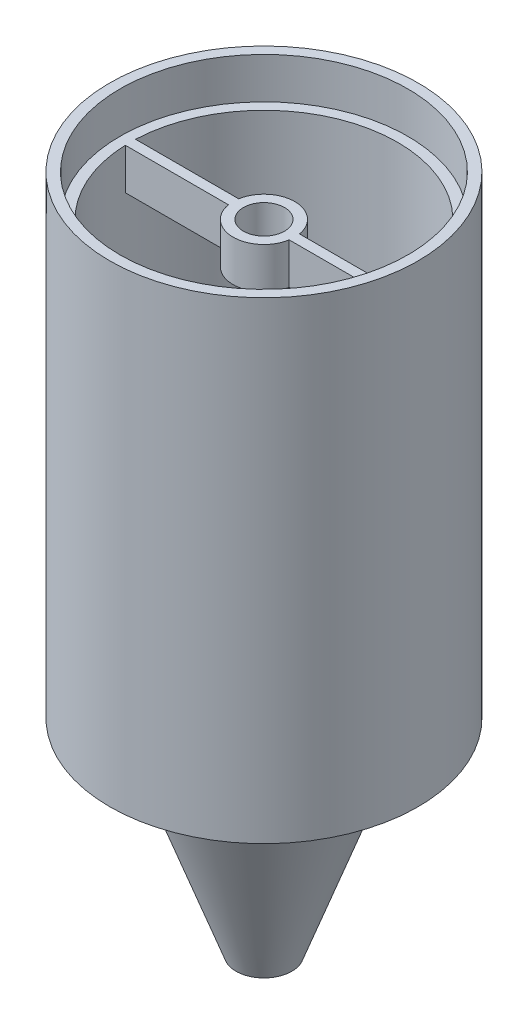
ISO-10303-21;
HEADER;
FILE_DESCRIPTION(('STEP AP214'),'2;1');
FILE_NAME('part.step','',(''),(''),'','','');
FILE_SCHEMA(('AUTOMOTIVE_DESIGN { 1 0 10303 214 1 1 1 1 }'));
ENDSEC;
DATA;
#1=APPLICATION_CONTEXT('core data for automotive mechanical design processes');
#2=APPLICATION_PROTOCOL_DEFINITION('international standard','automotive_design',2000,#1);
#3=PRODUCT_CONTEXT('',#1,'mechanical');
#4=PRODUCT('Part','Part','',(#3));
#5=PRODUCT_RELATED_PRODUCT_CATEGORY('part','',(#4));
#6=PRODUCT_DEFINITION_FORMATION('','',#4);
#7=PRODUCT_DEFINITION_CONTEXT('part definition',#1,'design');
#8=PRODUCT_DEFINITION('design','',#6,#7);
#9=PRODUCT_DEFINITION_SHAPE('','',#8);
#10=(LENGTH_UNIT() NAMED_UNIT(*) SI_UNIT(.MILLI.,.METRE.));
#11=(NAMED_UNIT(*) PLANE_ANGLE_UNIT() SI_UNIT($,.RADIAN.));
#12=(NAMED_UNIT(*) SI_UNIT($,.STERADIAN.) SOLID_ANGLE_UNIT());
#13=UNCERTAINTY_MEASURE_WITH_UNIT(LENGTH_MEASURE(1.E-05),#10,'distance_accuracy_value','');
#14=(GEOMETRIC_REPRESENTATION_CONTEXT(3) GLOBAL_UNCERTAINTY_ASSIGNED_CONTEXT((#13)) GLOBAL_UNIT_ASSIGNED_CONTEXT((#10,
#11,#12)) REPRESENTATION_CONTEXT('',''));
#15=CARTESIAN_POINT('',(0.,0.,0.));
#16=DIRECTION('',(0.,0.,1.));
#17=DIRECTION('',(1.,0.,0.));
#18=AXIS2_PLACEMENT_3D('',#15,#16,#17);
#19=CARTESIAN_POINT('',(0.,53.34,0.));
#20=DIRECTION('',(0.,-1.,0.));
#21=DIRECTION('',(0.,0.,-1.));
#22=AXIS2_PLACEMENT_3D('',#19,#20,#21);
#23=CYLINDRICAL_SURFACE('',#22,16.51);
#24=CARTESIAN_POINT('',(0.,2.54,0.));
#25=DIRECTION('',(0.,1.,0.));
#26=DIRECTION('',(0.,0.,1.));
#27=AXIS2_PLACEMENT_3D('',#24,#25,#26);
#28=CIRCLE('',#27,16.51);
#29=CARTESIAN_POINT('',(0.,2.54,16.51));
#30=VERTEX_POINT('',#29);
#31=EDGE_CURVE('E180',#30,#30,#28,.F.);
#32=ORIENTED_EDGE('',*,*,#31,.T.);
#33=EDGE_LOOP('',(#32));
#34=FACE_BOUND('',#33,.T.);
#35=CARTESIAN_POINT('',(0.,48.26,0.));
#36=DIRECTION('',(0.,1.,0.));
#37=DIRECTION('',(0.,0.,1.));
#38=AXIS2_PLACEMENT_3D('',#35,#36,#37);
#39=CIRCLE('',#38,16.51);
#40=CARTESIAN_POINT('',(-16.4977839420936,48.26,-0.635000000000003));
#41=VERTEX_POINT('',#40);
#42=CARTESIAN_POINT('',(-16.4977839420936,48.26,0.634999999999997));
#43=VERTEX_POINT('',#42);
#44=EDGE_CURVE('E182',#41,#43,#39,.T.);
#45=ORIENTED_EDGE('',*,*,#44,.T.);
#46=DIRECTION('',(0.,1.,0.));
#47=VECTOR('',#46,1.);
#48=CARTESIAN_POINT('',(-16.4977839420936,48.26,0.634999999999997));
#49=LINE('',#48,#47);
#50=CARTESIAN_POINT('',(-16.4977839420936,53.34,0.634999999999997));
#51=VERTEX_POINT('',#50);
#52=EDGE_CURVE('E104',#43,#51,#49,.T.);
#53=ORIENTED_EDGE('',*,*,#52,.T.);
#54=CARTESIAN_POINT('',(0.,53.34,0.));
#55=DIRECTION('',(0.,1.,0.));
#56=DIRECTION('',(0.,0.,1.));
#57=AXIS2_PLACEMENT_3D('',#54,#55,#56);
#58=CIRCLE('',#57,16.51);
#59=CARTESIAN_POINT('',(16.4977839420936,53.34,0.634999999999997));
#60=VERTEX_POINT('',#59);
#61=EDGE_CURVE('E159',#51,#60,#58,.T.);
#62=ORIENTED_EDGE('',*,*,#61,.T.);
#63=DIRECTION('',(0.,1.,0.));
#64=VECTOR('',#63,1.);
#65=CARTESIAN_POINT('',(16.4977839420936,48.26,0.634999999999997));
#66=LINE('',#65,#64);
#67=CARTESIAN_POINT('',(16.4977839420936,48.26,0.634999999999997));
#68=VERTEX_POINT('',#67);
#69=EDGE_CURVE('E112',#68,#60,#66,.T.);
#70=ORIENTED_EDGE('',*,*,#69,.F.);
#71=CARTESIAN_POINT('',(16.4977839420936,48.26,-0.635000000000003));
#72=VERTEX_POINT('',#71);
#73=EDGE_CURVE('E40',#68,#72,#39,.T.);
#74=ORIENTED_EDGE('',*,*,#73,.T.);
#75=DIRECTION('',(0.,1.,0.));
#76=VECTOR('',#75,1.);
#77=CARTESIAN_POINT('',(16.4977839420936,48.26,-0.635000000000003));
#78=LINE('',#77,#76);
#79=CARTESIAN_POINT('',(16.4977839420936,53.34,-0.635000000000003));
#80=VERTEX_POINT('',#79);
#81=EDGE_CURVE('E147',#72,#80,#78,.T.);
#82=ORIENTED_EDGE('',*,*,#81,.T.);
#83=CARTESIAN_POINT('',(-16.4977839420936,53.34,-0.635000000000003));
#84=VERTEX_POINT('',#83);
#85=EDGE_CURVE('E164',#80,#84,#58,.T.);
#86=ORIENTED_EDGE('',*,*,#85,.T.);
#87=DIRECTION('',(0.,1.,0.));
#88=VECTOR('',#87,1.);
#89=CARTESIAN_POINT('',(-16.4977839420936,48.26,-0.635000000000003));
#90=LINE('',#89,#88);
#91=EDGE_CURVE('E140',#41,#84,#90,.T.);
#92=ORIENTED_EDGE('',*,*,#91,.F.);
#93=EDGE_LOOP('',(#45,#53,#62,#70,#74,#82,#86,#92));
#94=FACE_BOUND('',#93,.T.);
#95=ADVANCED_FACE('F32',(#34,#94),#23,.F.);
#96=CARTESIAN_POINT('',(0.,0.,0.));
#97=DIRECTION('',(0.,1.,0.));
#98=DIRECTION('',(0.,0.,1.));
#99=AXIS2_PLACEMENT_3D('',#96,#97,#98);
#100=PLANE('',#99);
#101=CARTESIAN_POINT('',(0.,0.,0.));
#102=DIRECTION('',(0.,1.,0.));
#103=DIRECTION('',(0.,0.,1.));
#104=AXIS2_PLACEMENT_3D('',#101,#102,#103);
#105=CIRCLE('',#104,19.05);
#106=CARTESIAN_POINT('',(0.,0.,19.05));
#107=VERTEX_POINT('',#106);
#108=EDGE_CURVE('E174',#107,#107,#105,.T.);
#109=ORIENTED_EDGE('',*,*,#108,.F.);
#110=EDGE_LOOP('',(#109));
#111=FACE_BOUND('',#110,.T.);
#112=CARTESIAN_POINT('',(0.,0.,0.));
#113=DIRECTION('',(0.,1.,0.));
#114=DIRECTION('',(0.,0.,1.));
#115=AXIS2_PLACEMENT_3D('',#112,#113,#114);
#116=CIRCLE('',#115,12.7);
#117=CARTESIAN_POINT('',(0.,0.,12.7));
#118=VERTEX_POINT('',#117);
#119=EDGE_CURVE('E177',#118,#118,#116,.F.);
#120=ORIENTED_EDGE('',*,*,#119,.F.);
#121=EDGE_LOOP('',(#120));
#122=FACE_BOUND('',#121,.T.);
#123=ADVANCED_FACE('F226',(#111,#122),#100,.F.);
#124=CARTESIAN_POINT('',(0.,2.54,0.));
#125=DIRECTION('',(0.,-1.,0.));
#126=DIRECTION('',(0.,0.,-1.));
#127=AXIS2_PLACEMENT_3D('',#124,#125,#126);
#128=CYLINDRICAL_SURFACE('',#127,19.05);
#129=ORIENTED_EDGE('',*,*,#108,.T.);
#130=EDGE_LOOP('',(#129));
#131=FACE_BOUND('',#130,.T.);
#132=CARTESIAN_POINT('',(0.,58.42,0.));
#133=DIRECTION('',(0.,1.,0.));
#134=DIRECTION('',(0.,0.,1.));
#135=AXIS2_PLACEMENT_3D('',#132,#133,#134);
#136=CIRCLE('',#135,19.05);
#137=CARTESIAN_POINT('',(0.,58.42,19.05));
#138=VERTEX_POINT('',#137);
#139=EDGE_CURVE('E123',#138,#138,#136,.T.);
#140=ORIENTED_EDGE('',*,*,#139,.F.);
#141=EDGE_LOOP('',(#140));
#142=FACE_BOUND('',#141,.T.);
#143=ADVANCED_FACE('F34',(#131,#142),#128,.T.);
#144=CARTESIAN_POINT('',(0.,2.54,0.));
#145=DIRECTION('',(0.,1.,0.));
#146=DIRECTION('',(0.,0.,1.));
#147=AXIS2_PLACEMENT_3D('',#144,#145,#146);
#148=PLANE('',#147);
#149=ORIENTED_EDGE('',*,*,#31,.F.);
#150=EDGE_LOOP('',(#149));
#151=FACE_BOUND('',#150,.T.);
#152=CARTESIAN_POINT('',(0.,2.54,0.));
#153=DIRECTION('',(0.,1.,0.));
#154=DIRECTION('',(0.,0.,1.));
#155=AXIS2_PLACEMENT_3D('',#152,#153,#154);
#156=CIRCLE('',#155,12.7093283453977);
#157=CARTESIAN_POINT('',(0.,2.54,12.7093283453977));
#158=VERTEX_POINT('',#157);
#159=EDGE_CURVE('E169',#158,#158,#156,.F.);
#160=ORIENTED_EDGE('',*,*,#159,.T.);
#161=EDGE_LOOP('',(#160));
#162=FACE_BOUND('',#161,.T.);
#163=ADVANCED_FACE('F244',(#151,#162),#148,.T.);
#164=CARTESIAN_POINT('',(0.,0.,0.));
#165=DIRECTION('',(0.,1.,0.));
#166=DIRECTION('',(0.,0.,-1.));
#167=AXIS2_PLACEMENT_3D('',#164,#165,#166);
#168=CONICAL_SURFACE('',#167,12.7,0.349065850398867);
#169=CARTESIAN_POINT('',(0.,-25.4,0.));
#170=DIRECTION('',(0.,-1.,0.));
#171=DIRECTION('',(0.,0.,-1.));
#172=AXIS2_PLACEMENT_3D('',#169,#170,#171);
#173=CIRCLE('',#172,3.45515604963844);
#174=CARTESIAN_POINT('',(0.,-25.4,-3.45515604963844));
#175=VERTEX_POINT('',#174);
#176=EDGE_CURVE('E168',#175,#175,#173,.T.);
#177=ORIENTED_EDGE('',*,*,#176,.F.);
#178=EDGE_LOOP('',(#177));
#179=FACE_BOUND('',#178,.T.);
#180=ORIENTED_EDGE('',*,*,#119,.T.);
#181=EDGE_LOOP('',(#180));
#182=FACE_BOUND('',#181,.T.);
#183=ADVANCED_FACE('F240',(#179,#182),#168,.T.);
#184=CARTESIAN_POINT('',(0.,-25.4,0.));
#185=DIRECTION('',(0.,-1.,0.));
#186=DIRECTION('',(0.,0.,-1.));
#187=AXIS2_PLACEMENT_3D('',#184,#185,#186);
#188=PLANE('',#187);
#189=CARTESIAN_POINT('',(0.,-25.4,0.));
#190=DIRECTION('',(0.,-1.,0.));
#191=DIRECTION('',(0.,0.,-1.));
#192=AXIS2_PLACEMENT_3D('',#189,#190,#191);
#193=CIRCLE('',#192,2.54);
#194=CARTESIAN_POINT('',(0.,-25.4,-2.54));
#195=VERTEX_POINT('',#194);
#196=EDGE_CURVE('E165',#195,#195,#193,.T.);
#197=ORIENTED_EDGE('',*,*,#196,.F.);
#198=EDGE_LOOP('',(#197));
#199=FACE_BOUND('',#198,.T.);
#200=ORIENTED_EDGE('',*,*,#176,.T.);
#201=EDGE_LOOP('',(#200));
#202=FACE_BOUND('',#201,.T.);
#203=ADVANCED_FACE('F236',(#199,#202),#188,.T.);
#204=CARTESIAN_POINT('',(0.,-25.4,0.));
#205=DIRECTION('',(0.,1.,0.));
#206=DIRECTION('',(0.,0.,-1.));
#207=AXIS2_PLACEMENT_3D('',#204,#205,#206);
#208=CONICAL_SURFACE('',#207,2.54,0.349065850398867);
#209=ORIENTED_EDGE('',*,*,#159,.F.);
#210=EDGE_LOOP('',(#209));
#211=FACE_BOUND('',#210,.T.);
#212=ORIENTED_EDGE('',*,*,#196,.T.);
#213=EDGE_LOOP('',(#212));
#214=FACE_BOUND('',#213,.T.);
#215=ADVANCED_FACE('F206',(#211,#214),#208,.F.);
#216=CARTESIAN_POINT('',(0.,53.34,0.));
#217=DIRECTION('',(0.,1.,0.));
#218=DIRECTION('',(0.,0.,1.));
#219=AXIS2_PLACEMENT_3D('',#216,#217,#218);
#220=PLANE('',#219);
#221=CARTESIAN_POINT('',(0.,53.34,0.));
#222=DIRECTION('',(0.,1.,0.));
#223=DIRECTION('',(0.,0.,1.));
#224=AXIS2_PLACEMENT_3D('',#221,#222,#223);
#225=CIRCLE('',#224,17.78);
#226=CARTESIAN_POINT('',(0.,53.34,17.78));
#227=VERTEX_POINT('',#226);
#228=EDGE_CURVE('E11',#227,#227,#225,.F.);
#229=ORIENTED_EDGE('',*,*,#228,.F.);
#230=EDGE_LOOP('',(#229));
#231=FACE_BOUND('',#230,.T.);
#232=ORIENTED_EDGE('',*,*,#85,.F.);
#233=DIRECTION('',(1.,0.,0.));
#234=VECTOR('',#233,1.);
#235=CARTESIAN_POINT('',(3.75671066226826,53.34,-0.635000000000003));
#236=LINE('',#235,#234);
#237=CARTESIAN_POINT('',(3.75671066226826,53.34,-0.635000000000003));
#238=VERTEX_POINT('',#237);
#239=EDGE_CURVE('E134',#238,#80,#236,.T.);
#240=ORIENTED_EDGE('',*,*,#239,.F.);
#241=CARTESIAN_POINT('',(0.,53.34,0.));
#242=DIRECTION('',(0.,-1.,0.));
#243=DIRECTION('',(0.,0.,-1.));
#244=AXIS2_PLACEMENT_3D('',#241,#242,#243);
#245=CIRCLE('',#244,3.81);
#246=CARTESIAN_POINT('',(-3.75671066226826,53.34,-0.635000000000001));
#247=VERTEX_POINT('',#246);
#248=EDGE_CURVE('E143',#247,#238,#245,.T.);
#249=ORIENTED_EDGE('',*,*,#248,.F.);
#250=DIRECTION('',(1.,0.,0.));
#251=VECTOR('',#250,1.);
#252=CARTESIAN_POINT('',(-3.75671066226826,53.34,-0.635000000000003));
#253=LINE('',#252,#251);
#254=EDGE_CURVE('E126',#84,#247,#253,.T.);
#255=ORIENTED_EDGE('',*,*,#254,.F.);
#256=EDGE_LOOP('',(#232,#240,#249,#255));
#257=FACE_BOUND('',#256,.T.);
#258=DIRECTION('',(-1.,0.,0.));
#259=VECTOR('',#258,1.);
#260=CARTESIAN_POINT('',(3.75671066226826,53.34,0.634999999999997));
#261=LINE('',#260,#259);
#262=CARTESIAN_POINT('',(3.75671066226826,53.34,0.634999999999997));
#263=VERTEX_POINT('',#262);
#264=EDGE_CURVE('E120',#60,#263,#261,.T.);
#265=ORIENTED_EDGE('',*,*,#264,.F.);
#266=ORIENTED_EDGE('',*,*,#61,.F.);
#267=DIRECTION('',(-1.,0.,0.));
#268=VECTOR('',#267,1.);
#269=CARTESIAN_POINT('',(-3.75671066226826,53.34,0.634999999999997));
#270=LINE('',#269,#268);
#271=CARTESIAN_POINT('',(-3.75671066226826,53.34,0.634999999999998));
#272=VERTEX_POINT('',#271);
#273=EDGE_CURVE('E55',#272,#51,#270,.T.);
#274=ORIENTED_EDGE('',*,*,#273,.F.);
#275=CARTESIAN_POINT('',(0.,53.34,0.));
#276=DIRECTION('',(0.,-1.,0.));
#277=DIRECTION('',(0.,0.,1.));
#278=AXIS2_PLACEMENT_3D('',#275,#276,#277);
#279=CIRCLE('',#278,3.81);
#280=EDGE_CURVE('E103',#263,#272,#279,.T.);
#281=ORIENTED_EDGE('',*,*,#280,.F.);
#282=EDGE_LOOP('',(#265,#266,#274,#281));
#283=FACE_BOUND('',#282,.T.);
#284=CARTESIAN_POINT('',(0.,53.34,0.));
#285=DIRECTION('',(0.,1.,0.));
#286=DIRECTION('',(0.,0.,1.));
#287=AXIS2_PLACEMENT_3D('',#284,#285,#286);
#288=CIRCLE('',#287,2.54);
#289=CARTESIAN_POINT('',(0.,53.34,2.54));
#290=VERTEX_POINT('',#289);
#291=EDGE_CURVE('E150',#290,#290,#288,.T.);
#292=ORIENTED_EDGE('',*,*,#291,.F.);
#293=EDGE_LOOP('',(#292));
#294=FACE_BOUND('',#293,.T.);
#295=ADVANCED_FACE('F203',(#231,#257,#283,#294),#220,.T.);
#296=CARTESIAN_POINT('',(0.,48.26,0.));
#297=DIRECTION('',(0.,1.,0.));
#298=DIRECTION('',(0.,0.,1.));
#299=AXIS2_PLACEMENT_3D('',#296,#297,#298);
#300=PLANE('',#299);
#301=ORIENTED_EDGE('',*,*,#73,.F.);
#302=DIRECTION('',(-1.,0.,0.));
#303=VECTOR('',#302,1.);
#304=CARTESIAN_POINT('',(3.75671066226826,48.26,0.634999999999997));
#305=LINE('',#304,#303);
#306=CARTESIAN_POINT('',(3.75671066226826,48.26,0.634999999999997));
#307=VERTEX_POINT('',#306);
#308=EDGE_CURVE('E47',#68,#307,#305,.T.);
#309=ORIENTED_EDGE('',*,*,#308,.T.);
#310=CARTESIAN_POINT('',(0.,48.26,0.));
#311=DIRECTION('',(0.,-1.,0.));
#312=DIRECTION('',(0.,0.,1.));
#313=AXIS2_PLACEMENT_3D('',#310,#311,#312);
#314=CIRCLE('',#313,3.81);
#315=CARTESIAN_POINT('',(-3.75671066226826,48.26,0.634999999999998));
#316=VERTEX_POINT('',#315);
#317=EDGE_CURVE('E101',#307,#316,#314,.T.);
#318=ORIENTED_EDGE('',*,*,#317,.T.);
#319=DIRECTION('',(-1.,0.,0.));
#320=VECTOR('',#319,1.);
#321=CARTESIAN_POINT('',(-3.75671066226826,48.26,0.634999999999997));
#322=LINE('',#321,#320);
#323=EDGE_CURVE('E108',#316,#43,#322,.T.);
#324=ORIENTED_EDGE('',*,*,#323,.T.);
#325=ORIENTED_EDGE('',*,*,#44,.F.);
#326=DIRECTION('',(1.,0.,0.));
#327=VECTOR('',#326,1.);
#328=CARTESIAN_POINT('',(-3.75671066226826,48.26,-0.635000000000003));
#329=LINE('',#328,#327);
#330=CARTESIAN_POINT('',(-3.75671066226826,48.26,-0.635000000000003));
#331=VERTEX_POINT('',#330);
#332=EDGE_CURVE('E130',#41,#331,#329,.T.);
#333=ORIENTED_EDGE('',*,*,#332,.T.);
#334=CARTESIAN_POINT('',(0.,48.26,0.));
#335=DIRECTION('',(0.,-1.,0.));
#336=DIRECTION('',(0.,0.,-1.));
#337=AXIS2_PLACEMENT_3D('',#334,#335,#336);
#338=CIRCLE('',#337,3.81);
#339=CARTESIAN_POINT('',(3.75671066226826,48.26,-0.635000000000003));
#340=VERTEX_POINT('',#339);
#341=EDGE_CURVE('E133',#331,#340,#338,.T.);
#342=ORIENTED_EDGE('',*,*,#341,.T.);
#343=DIRECTION('',(1.,0.,0.));
#344=VECTOR('',#343,1.);
#345=CARTESIAN_POINT('',(3.75671066226826,48.26,-0.635000000000003));
#346=LINE('',#345,#344);
#347=EDGE_CURVE('E137',#340,#72,#346,.T.);
#348=ORIENTED_EDGE('',*,*,#347,.T.);
#349=EDGE_LOOP('',(#301,#309,#318,#324,#325,#333,#342,#348));
#350=FACE_BOUND('',#349,.T.);
#351=CARTESIAN_POINT('',(0.,48.26,0.));
#352=DIRECTION('',(0.,1.,0.));
#353=DIRECTION('',(0.,0.,1.));
#354=AXIS2_PLACEMENT_3D('',#351,#352,#353);
#355=CIRCLE('',#354,2.54);
#356=CARTESIAN_POINT('',(0.,48.26,2.54));
#357=VERTEX_POINT('',#356);
#358=EDGE_CURVE('E156',#357,#357,#355,.T.);
#359=ORIENTED_EDGE('',*,*,#358,.T.);
#360=EDGE_LOOP('',(#359));
#361=FACE_BOUND('',#360,.T.);
#362=ADVANCED_FACE('F114',(#350,#361),#300,.F.);
#363=CARTESIAN_POINT('',(0.,48.26,0.));
#364=DIRECTION('',(0.,1.,0.));
#365=DIRECTION('',(0.,0.,1.));
#366=AXIS2_PLACEMENT_3D('',#363,#364,#365);
#367=CYLINDRICAL_SURFACE('',#366,2.54);
#368=ORIENTED_EDGE('',*,*,#358,.F.);
#369=EDGE_LOOP('',(#368));
#370=FACE_BOUND('',#369,.T.);
#371=ORIENTED_EDGE('',*,*,#291,.T.);
#372=EDGE_LOOP('',(#371));
#373=FACE_BOUND('',#372,.T.);
#374=ADVANCED_FACE('F213',(#370,#373),#367,.F.);
#375=CARTESIAN_POINT('',(3.75671066226826,48.26,-0.635000000000003));
#376=DIRECTION('',(0.,0.,1.));
#377=DIRECTION('',(1.,0.,0.));
#378=AXIS2_PLACEMENT_3D('',#375,#376,#377);
#379=PLANE('',#378);
#380=ORIENTED_EDGE('',*,*,#239,.T.);
#381=ORIENTED_EDGE('',*,*,#81,.F.);
#382=ORIENTED_EDGE('',*,*,#347,.F.);
#383=DIRECTION('',(0.,1.,0.));
#384=VECTOR('',#383,1.);
#385=CARTESIAN_POINT('',(3.75671066226826,48.26,-0.635000000000003));
#386=LINE('',#385,#384);
#387=EDGE_CURVE('E151',#340,#238,#386,.T.);
#388=ORIENTED_EDGE('',*,*,#387,.T.);
#389=EDGE_LOOP('',(#380,#381,#382,#388));
#390=FACE_BOUND('',#389,.T.);
#391=ADVANCED_FACE('F200',(#390),#379,.F.);
#392=CARTESIAN_POINT('',(0.,48.26,0.));
#393=DIRECTION('',(0.,1.,0.));
#394=DIRECTION('',(0.,0.,1.));
#395=AXIS2_PLACEMENT_3D('',#392,#393,#394);
#396=CYLINDRICAL_SURFACE('',#395,3.81);
#397=ORIENTED_EDGE('',*,*,#248,.T.);
#398=ORIENTED_EDGE('',*,*,#387,.F.);
#399=ORIENTED_EDGE('',*,*,#341,.F.);
#400=DIRECTION('',(0.,1.,0.));
#401=VECTOR('',#400,1.);
#402=CARTESIAN_POINT('',(-3.75671066226826,48.26,-0.635000000000001));
#403=LINE('',#402,#401);
#404=EDGE_CURVE('E153',#331,#247,#403,.T.);
#405=ORIENTED_EDGE('',*,*,#404,.T.);
#406=EDGE_LOOP('',(#397,#398,#399,#405));
#407=FACE_BOUND('',#406,.T.);
#408=ADVANCED_FACE('F196',(#407),#396,.T.);
#409=CARTESIAN_POINT('',(-3.75671066226826,48.26,-0.635000000000003));
#410=DIRECTION('',(0.,0.,1.));
#411=DIRECTION('',(1.,0.,0.));
#412=AXIS2_PLACEMENT_3D('',#409,#410,#411);
#413=PLANE('',#412);
#414=ORIENTED_EDGE('',*,*,#254,.T.);
#415=ORIENTED_EDGE('',*,*,#404,.F.);
#416=ORIENTED_EDGE('',*,*,#332,.F.);
#417=ORIENTED_EDGE('',*,*,#91,.T.);
#418=EDGE_LOOP('',(#414,#415,#416,#417));
#419=FACE_BOUND('',#418,.T.);
#420=ADVANCED_FACE('F192',(#419),#413,.F.);
#421=CARTESIAN_POINT('',(-3.75671066226826,48.26,0.634999999999997));
#422=DIRECTION('',(0.,0.,-1.));
#423=DIRECTION('',(-1.,0.,0.));
#424=AXIS2_PLACEMENT_3D('',#421,#422,#423);
#425=PLANE('',#424);
#426=ORIENTED_EDGE('',*,*,#273,.T.);
#427=ORIENTED_EDGE('',*,*,#52,.F.);
#428=ORIENTED_EDGE('',*,*,#323,.F.);
#429=DIRECTION('',(0.,1.,0.));
#430=VECTOR('',#429,1.);
#431=CARTESIAN_POINT('',(-3.75671066226826,48.26,0.634999999999998));
#432=LINE('',#431,#430);
#433=EDGE_CURVE('E97',#316,#272,#432,.T.);
#434=ORIENTED_EDGE('',*,*,#433,.T.);
#435=EDGE_LOOP('',(#426,#427,#428,#434));
#436=FACE_BOUND('',#435,.T.);
#437=ADVANCED_FACE('F109',(#436),#425,.F.);
#438=CARTESIAN_POINT('',(0.,48.26,0.));
#439=DIRECTION('',(0.,1.,0.));
#440=DIRECTION('',(0.,0.,1.));
#441=AXIS2_PLACEMENT_3D('',#438,#439,#440);
#442=CYLINDRICAL_SURFACE('',#441,3.81);
#443=ORIENTED_EDGE('',*,*,#280,.T.);
#444=ORIENTED_EDGE('',*,*,#433,.F.);
#445=ORIENTED_EDGE('',*,*,#317,.F.);
#446=DIRECTION('',(0.,1.,0.));
#447=VECTOR('',#446,1.);
#448=CARTESIAN_POINT('',(3.75671066226826,48.26,0.634999999999997));
#449=LINE('',#448,#447);
#450=EDGE_CURVE('E105',#307,#263,#449,.T.);
#451=ORIENTED_EDGE('',*,*,#450,.T.);
#452=EDGE_LOOP('',(#443,#444,#445,#451));
#453=FACE_BOUND('',#452,.T.);
#454=ADVANCED_FACE('F99',(#453),#442,.T.);
#455=CARTESIAN_POINT('',(3.75671066226826,48.26,0.634999999999997));
#456=DIRECTION('',(0.,0.,-1.));
#457=DIRECTION('',(-1.,0.,0.));
#458=AXIS2_PLACEMENT_3D('',#455,#456,#457);
#459=PLANE('',#458);
#460=ORIENTED_EDGE('',*,*,#264,.T.);
#461=ORIENTED_EDGE('',*,*,#450,.F.);
#462=ORIENTED_EDGE('',*,*,#308,.F.);
#463=ORIENTED_EDGE('',*,*,#69,.T.);
#464=EDGE_LOOP('',(#460,#461,#462,#463));
#465=FACE_BOUND('',#464,.T.);
#466=ADVANCED_FACE('F279',(#465),#459,.F.);
#467=CARTESIAN_POINT('',(0.,58.42,0.));
#468=DIRECTION('',(0.,1.,0.));
#469=DIRECTION('',(0.,0.,1.));
#470=AXIS2_PLACEMENT_3D('',#467,#468,#469);
#471=PLANE('',#470);
#472=ORIENTED_EDGE('',*,*,#139,.T.);
#473=EDGE_LOOP('',(#472));
#474=FACE_BOUND('',#473,.T.);
#475=CARTESIAN_POINT('',(0.,58.42,0.));
#476=DIRECTION('',(0.,1.,0.));
#477=DIRECTION('',(0.,0.,1.));
#478=AXIS2_PLACEMENT_3D('',#475,#476,#477);
#479=CIRCLE('',#478,17.78);
#480=CARTESIAN_POINT('',(0.,58.42,17.78));
#481=VERTEX_POINT('',#480);
#482=EDGE_CURVE('E269',#481,#481,#479,.T.);
#483=ORIENTED_EDGE('',*,*,#482,.F.);
#484=EDGE_LOOP('',(#483));
#485=FACE_BOUND('',#484,.T.);
#486=ADVANCED_FACE('F277',(#474,#485),#471,.T.);
#487=CARTESIAN_POINT('',(0.,58.42,0.));
#488=DIRECTION('',(0.,-1.,0.));
#489=DIRECTION('',(0.,0.,-1.));
#490=AXIS2_PLACEMENT_3D('',#487,#488,#489);
#491=CYLINDRICAL_SURFACE('',#490,17.78);
#492=ORIENTED_EDGE('',*,*,#482,.T.);
#493=EDGE_LOOP('',(#492));
#494=FACE_BOUND('',#493,.T.);
#495=ORIENTED_EDGE('',*,*,#228,.T.);
#496=EDGE_LOOP('',(#495));
#497=FACE_BOUND('',#496,.T.);
#498=ADVANCED_FACE('F274',(#494,#497),#491,.F.);
#499=CLOSED_SHELL('',(#95,#123,#143,#163,#183,#203,#215,#295,#362,#374,#391,#408,#420,#437,#454,
#466,#486,#498));
#500=MANIFOLD_SOLID_BREP('B2',#499);
#501=ADVANCED_BREP_SHAPE_REPRESENTATION('',(#18,#500),#14);
#502=SHAPE_DEFINITION_REPRESENTATION(#9,#501);
ENDSEC;
END-ISO-10303-21;
